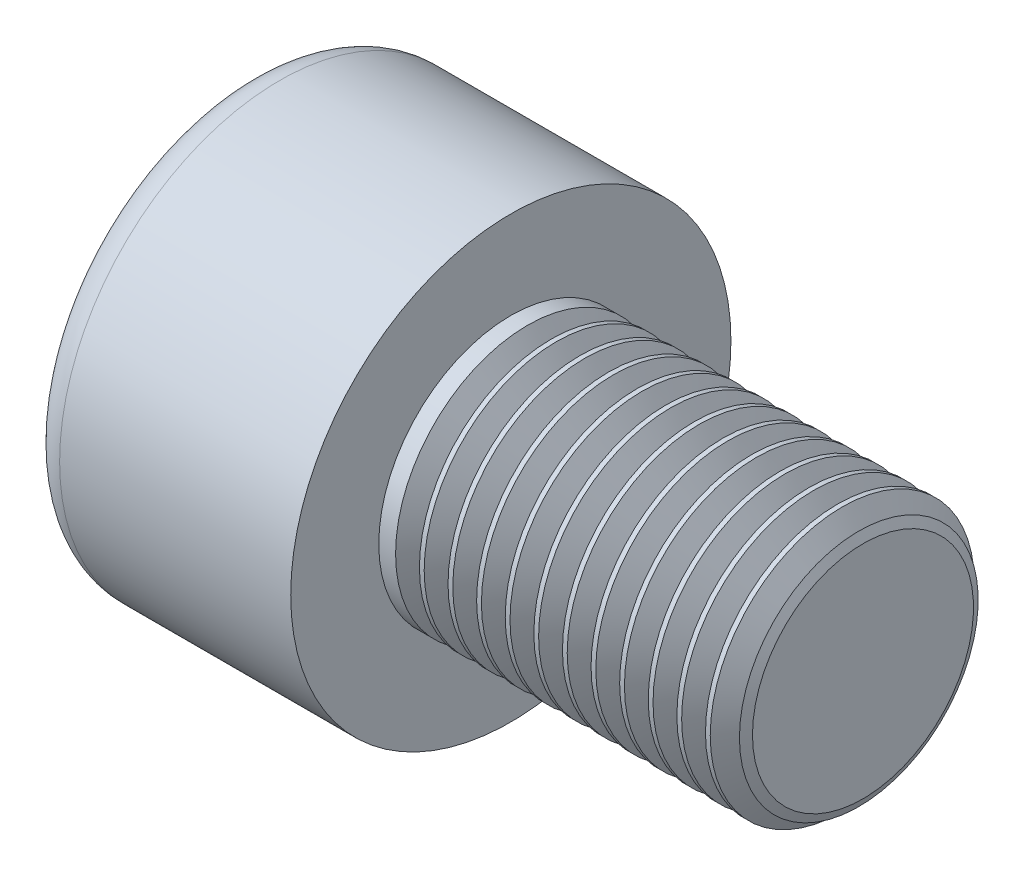
ISO-10303-21;
HEADER;
FILE_DESCRIPTION(('STEP AP214'),'2;1');
FILE_NAME('part.step','',(''),(''),'','','');
FILE_SCHEMA(('AUTOMOTIVE_DESIGN { 1 0 10303 214 1 1 1 1 }'));
ENDSEC;
DATA;
#1=APPLICATION_CONTEXT('core data for automotive mechanical design processes');
#2=APPLICATION_PROTOCOL_DEFINITION('international standard','automotive_design',2000,#1);
#3=PRODUCT_CONTEXT('',#1,'mechanical');
#4=PRODUCT('Part','Part','',(#3));
#5=PRODUCT_RELATED_PRODUCT_CATEGORY('part','',(#4));
#6=PRODUCT_DEFINITION_FORMATION('','',#4);
#7=PRODUCT_DEFINITION_CONTEXT('part definition',#1,'design');
#8=PRODUCT_DEFINITION('design','',#6,#7);
#9=PRODUCT_DEFINITION_SHAPE('','',#8);
#10=(LENGTH_UNIT() NAMED_UNIT(*) SI_UNIT(.MILLI.,.METRE.));
#11=(NAMED_UNIT(*) PLANE_ANGLE_UNIT() SI_UNIT($,.RADIAN.));
#12=(NAMED_UNIT(*) SI_UNIT($,.STERADIAN.) SOLID_ANGLE_UNIT());
#13=UNCERTAINTY_MEASURE_WITH_UNIT(LENGTH_MEASURE(1.E-05),#10,'distance_accuracy_value','');
#14=(GEOMETRIC_REPRESENTATION_CONTEXT(3) GLOBAL_UNCERTAINTY_ASSIGNED_CONTEXT((#13)) GLOBAL_UNIT_ASSIGNED_CONTEXT((#10,
#11,#12)) REPRESENTATION_CONTEXT('',''));
#15=CARTESIAN_POINT('',(0.,0.,0.));
#16=DIRECTION('',(0.,0.,1.));
#17=DIRECTION('',(1.,0.,0.));
#18=AXIS2_PLACEMENT_3D('',#15,#16,#17);
#19=CARTESIAN_POINT('',(13.8006,0.,0.));
#20=DIRECTION('',(1.,0.,0.));
#21=DIRECTION('',(0.,0.,-1.));
#22=AXIS2_PLACEMENT_3D('',#19,#20,#21);
#23=CONICAL_SURFACE('',#22,2.53104724385073,1.0471975511966);
#24=CARTESIAN_POINT('',(13.8006,0.,0.));
#25=DIRECTION('',(-1.,0.,0.));
#26=DIRECTION('',(0.,0.,1.));
#27=AXIS2_PLACEMENT_3D('',#24,#25,#26);
#28=CIRCLE('',#27,2.53104724385073);
#29=CARTESIAN_POINT('',(13.8006,0.,2.53104724385073));
#30=VERTEX_POINT('',#29);
#31=EDGE_CURVE('E121',#30,#30,#28,.T.);
#32=ORIENTED_EDGE('',*,*,#31,.F.);
#33=EDGE_LOOP('',(#32));
#34=FACE_BOUND('',#33,.T.);
#35=CARTESIAN_POINT('',(13.9049871614403,0.,0.));
#36=DIRECTION('',(-1.,0.,0.));
#37=DIRECTION('',(0.,0.,1.));
#38=AXIS2_PLACEMENT_3D('',#35,#36,#37);
#39=CIRCLE('',#38,2.71185111112316);
#40=CARTESIAN_POINT('',(13.9049871614403,0.,2.71185111112316));
#41=VERTEX_POINT('',#40);
#42=EDGE_CURVE('E642',#41,#41,#39,.T.);
#43=ORIENTED_EDGE('',*,*,#42,.T.);
#44=EDGE_LOOP('',(#43));
#45=FACE_BOUND('',#44,.T.);
#46=ADVANCED_FACE('F31',(#34,#45),#23,.T.);
#47=CARTESIAN_POINT('',(16.,0.,0.));
#48=DIRECTION('',(-1.,0.,0.));
#49=DIRECTION('',(0.,0.,1.));
#50=AXIS2_PLACEMENT_3D('',#47,#48,#49);
#51=CYLINDRICAL_SURFACE('',#50,3.);
#52=CARTESIAN_POINT('',(7.03185,0.,0.));
#53=DIRECTION('',(-1.,0.,0.));
#54=DIRECTION('',(0.,0.,1.));
#55=AXIS2_PLACEMENT_3D('',#52,#53,#54);
#56=CIRCLE('',#55,3.);
#57=CARTESIAN_POINT('',(7.03185,0.,3.));
#58=VERTEX_POINT('',#57);
#59=EDGE_CURVE('E654',#58,#58,#56,.T.);
#60=ORIENTED_EDGE('',*,*,#59,.T.);
#61=EDGE_LOOP('',(#60));
#62=FACE_BOUND('',#61,.T.);
#63=CARTESIAN_POINT('',(6.92355,0.,0.));
#64=DIRECTION('',(-1.,0.,0.));
#65=DIRECTION('',(0.,0.,1.));
#66=AXIS2_PLACEMENT_3D('',#63,#64,#65);
#67=CIRCLE('',#66,3.);
#68=CARTESIAN_POINT('',(6.92355,0.,3.));
#69=VERTEX_POINT('',#68);
#70=EDGE_CURVE('E641',#69,#69,#67,.T.);
#71=ORIENTED_EDGE('',*,*,#70,.F.);
#72=EDGE_LOOP('',(#71));
#73=FACE_BOUND('',#72,.T.);
#74=ADVANCED_FACE('F237',(#62,#73),#51,.T.);
#75=CARTESIAN_POINT('',(7.68165,0.,0.));
#76=DIRECTION('',(-1.,0.,0.));
#77=DIRECTION('',(0.,0.,1.));
#78=AXIS2_PLACEMENT_3D('',#75,#76,#77);
#79=CIRCLE('',#78,3.);
#80=CARTESIAN_POINT('',(7.68165,0.,3.));
#81=VERTEX_POINT('',#80);
#82=EDGE_CURVE('E663',#81,#81,#79,.T.);
#83=ORIENTED_EDGE('',*,*,#82,.T.);
#84=EDGE_LOOP('',(#83));
#85=FACE_BOUND('',#84,.T.);
#86=CARTESIAN_POINT('',(7.57335,0.,0.));
#87=DIRECTION('',(-1.,0.,0.));
#88=DIRECTION('',(0.,0.,1.));
#89=AXIS2_PLACEMENT_3D('',#86,#87,#88);
#90=CIRCLE('',#89,3.);
#91=CARTESIAN_POINT('',(7.57335,0.,3.));
#92=VERTEX_POINT('',#91);
#93=EDGE_CURVE('E657',#92,#92,#90,.T.);
#94=ORIENTED_EDGE('',*,*,#93,.F.);
#95=EDGE_LOOP('',(#94));
#96=FACE_BOUND('',#95,.T.);
#97=ADVANCED_FACE('F243',(#85,#96),#51,.T.);
#98=CARTESIAN_POINT('',(8.33145,0.,0.));
#99=DIRECTION('',(-1.,0.,0.));
#100=DIRECTION('',(0.,0.,1.));
#101=AXIS2_PLACEMENT_3D('',#98,#99,#100);
#102=CIRCLE('',#101,3.);
#103=CARTESIAN_POINT('',(8.33145,0.,3.));
#104=VERTEX_POINT('',#103);
#105=EDGE_CURVE('E672',#104,#104,#102,.T.);
#106=ORIENTED_EDGE('',*,*,#105,.T.);
#107=EDGE_LOOP('',(#106));
#108=FACE_BOUND('',#107,.T.);
#109=CARTESIAN_POINT('',(8.22315,0.,0.));
#110=DIRECTION('',(-1.,0.,0.));
#111=DIRECTION('',(0.,0.,1.));
#112=AXIS2_PLACEMENT_3D('',#109,#110,#111);
#113=CIRCLE('',#112,3.);
#114=CARTESIAN_POINT('',(8.22315,0.,3.));
#115=VERTEX_POINT('',#114);
#116=EDGE_CURVE('E666',#115,#115,#113,.T.);
#117=ORIENTED_EDGE('',*,*,#116,.F.);
#118=EDGE_LOOP('',(#117));
#119=FACE_BOUND('',#118,.T.);
#120=ADVANCED_FACE('F521',(#108,#119),#51,.T.);
#121=CARTESIAN_POINT('',(8.98125,0.,0.));
#122=DIRECTION('',(-1.,0.,0.));
#123=DIRECTION('',(0.,0.,1.));
#124=AXIS2_PLACEMENT_3D('',#121,#122,#123);
#125=CIRCLE('',#124,3.);
#126=CARTESIAN_POINT('',(8.98125,0.,3.));
#127=VERTEX_POINT('',#126);
#128=EDGE_CURVE('E681',#127,#127,#125,.T.);
#129=ORIENTED_EDGE('',*,*,#128,.T.);
#130=EDGE_LOOP('',(#129));
#131=FACE_BOUND('',#130,.T.);
#132=CARTESIAN_POINT('',(8.87295,0.,0.));
#133=DIRECTION('',(-1.,0.,0.));
#134=DIRECTION('',(0.,0.,1.));
#135=AXIS2_PLACEMENT_3D('',#132,#133,#134);
#136=CIRCLE('',#135,3.);
#137=CARTESIAN_POINT('',(8.87295,0.,3.));
#138=VERTEX_POINT('',#137);
#139=EDGE_CURVE('E675',#138,#138,#136,.T.);
#140=ORIENTED_EDGE('',*,*,#139,.F.);
#141=EDGE_LOOP('',(#140));
#142=FACE_BOUND('',#141,.T.);
#143=ADVANCED_FACE('F514',(#131,#142),#51,.T.);
#144=CARTESIAN_POINT('',(9.63105,0.,0.));
#145=DIRECTION('',(-1.,0.,0.));
#146=DIRECTION('',(0.,0.,1.));
#147=AXIS2_PLACEMENT_3D('',#144,#145,#146);
#148=CIRCLE('',#147,3.);
#149=CARTESIAN_POINT('',(9.63105,0.,3.));
#150=VERTEX_POINT('',#149);
#151=EDGE_CURVE('E690',#150,#150,#148,.T.);
#152=ORIENTED_EDGE('',*,*,#151,.T.);
#153=EDGE_LOOP('',(#152));
#154=FACE_BOUND('',#153,.T.);
#155=CARTESIAN_POINT('',(9.52275,0.,0.));
#156=DIRECTION('',(-1.,0.,0.));
#157=DIRECTION('',(0.,0.,1.));
#158=AXIS2_PLACEMENT_3D('',#155,#156,#157);
#159=CIRCLE('',#158,3.);
#160=CARTESIAN_POINT('',(9.52275,0.,3.));
#161=VERTEX_POINT('',#160);
#162=EDGE_CURVE('E684',#161,#161,#159,.T.);
#163=ORIENTED_EDGE('',*,*,#162,.F.);
#164=EDGE_LOOP('',(#163));
#165=FACE_BOUND('',#164,.T.);
#166=ADVANCED_FACE('F507',(#154,#165),#51,.T.);
#167=CARTESIAN_POINT('',(10.28085,0.,0.));
#168=DIRECTION('',(-1.,0.,0.));
#169=DIRECTION('',(0.,0.,1.));
#170=AXIS2_PLACEMENT_3D('',#167,#168,#169);
#171=CIRCLE('',#170,3.);
#172=CARTESIAN_POINT('',(10.28085,0.,3.));
#173=VERTEX_POINT('',#172);
#174=EDGE_CURVE('E699',#173,#173,#171,.T.);
#175=ORIENTED_EDGE('',*,*,#174,.T.);
#176=EDGE_LOOP('',(#175));
#177=FACE_BOUND('',#176,.T.);
#178=CARTESIAN_POINT('',(10.17255,0.,0.));
#179=DIRECTION('',(-1.,0.,0.));
#180=DIRECTION('',(0.,0.,1.));
#181=AXIS2_PLACEMENT_3D('',#178,#179,#180);
#182=CIRCLE('',#181,3.);
#183=CARTESIAN_POINT('',(10.17255,0.,3.));
#184=VERTEX_POINT('',#183);
#185=EDGE_CURVE('E693',#184,#184,#182,.T.);
#186=ORIENTED_EDGE('',*,*,#185,.F.);
#187=EDGE_LOOP('',(#186));
#188=FACE_BOUND('',#187,.T.);
#189=ADVANCED_FACE('F500',(#177,#188),#51,.T.);
#190=CARTESIAN_POINT('',(10.93065,0.,0.));
#191=DIRECTION('',(-1.,0.,0.));
#192=DIRECTION('',(0.,0.,1.));
#193=AXIS2_PLACEMENT_3D('',#190,#191,#192);
#194=CIRCLE('',#193,3.);
#195=CARTESIAN_POINT('',(10.93065,0.,3.));
#196=VERTEX_POINT('',#195);
#197=EDGE_CURVE('E708',#196,#196,#194,.T.);
#198=ORIENTED_EDGE('',*,*,#197,.T.);
#199=EDGE_LOOP('',(#198));
#200=FACE_BOUND('',#199,.T.);
#201=CARTESIAN_POINT('',(10.82235,0.,0.));
#202=DIRECTION('',(-1.,0.,0.));
#203=DIRECTION('',(0.,0.,1.));
#204=AXIS2_PLACEMENT_3D('',#201,#202,#203);
#205=CIRCLE('',#204,3.);
#206=CARTESIAN_POINT('',(10.82235,0.,3.));
#207=VERTEX_POINT('',#206);
#208=EDGE_CURVE('E702',#207,#207,#205,.T.);
#209=ORIENTED_EDGE('',*,*,#208,.F.);
#210=EDGE_LOOP('',(#209));
#211=FACE_BOUND('',#210,.T.);
#212=ADVANCED_FACE('F493',(#200,#211),#51,.T.);
#213=CARTESIAN_POINT('',(11.58045,0.,0.));
#214=DIRECTION('',(-1.,0.,0.));
#215=DIRECTION('',(0.,0.,1.));
#216=AXIS2_PLACEMENT_3D('',#213,#214,#215);
#217=CIRCLE('',#216,3.);
#218=CARTESIAN_POINT('',(11.58045,0.,3.));
#219=VERTEX_POINT('',#218);
#220=EDGE_CURVE('E717',#219,#219,#217,.T.);
#221=ORIENTED_EDGE('',*,*,#220,.T.);
#222=EDGE_LOOP('',(#221));
#223=FACE_BOUND('',#222,.T.);
#224=CARTESIAN_POINT('',(11.47215,0.,0.));
#225=DIRECTION('',(-1.,0.,0.));
#226=DIRECTION('',(0.,0.,1.));
#227=AXIS2_PLACEMENT_3D('',#224,#225,#226);
#228=CIRCLE('',#227,3.);
#229=CARTESIAN_POINT('',(11.47215,0.,3.));
#230=VERTEX_POINT('',#229);
#231=EDGE_CURVE('E711',#230,#230,#228,.T.);
#232=ORIENTED_EDGE('',*,*,#231,.F.);
#233=EDGE_LOOP('',(#232));
#234=FACE_BOUND('',#233,.T.);
#235=ADVANCED_FACE('F486',(#223,#234),#51,.T.);
#236=CARTESIAN_POINT('',(12.23025,0.,0.));
#237=DIRECTION('',(-1.,0.,0.));
#238=DIRECTION('',(0.,0.,1.));
#239=AXIS2_PLACEMENT_3D('',#236,#237,#238);
#240=CIRCLE('',#239,3.);
#241=CARTESIAN_POINT('',(12.23025,0.,3.));
#242=VERTEX_POINT('',#241);
#243=EDGE_CURVE('E726',#242,#242,#240,.T.);
#244=ORIENTED_EDGE('',*,*,#243,.T.);
#245=EDGE_LOOP('',(#244));
#246=FACE_BOUND('',#245,.T.);
#247=CARTESIAN_POINT('',(12.12195,0.,0.));
#248=DIRECTION('',(-1.,0.,0.));
#249=DIRECTION('',(0.,0.,1.));
#250=AXIS2_PLACEMENT_3D('',#247,#248,#249);
#251=CIRCLE('',#250,3.);
#252=CARTESIAN_POINT('',(12.12195,0.,3.));
#253=VERTEX_POINT('',#252);
#254=EDGE_CURVE('E720',#253,#253,#251,.T.);
#255=ORIENTED_EDGE('',*,*,#254,.F.);
#256=EDGE_LOOP('',(#255));
#257=FACE_BOUND('',#256,.T.);
#258=ADVANCED_FACE('F479',(#246,#257),#51,.T.);
#259=CARTESIAN_POINT('',(12.88005,0.,0.));
#260=DIRECTION('',(-1.,0.,0.));
#261=DIRECTION('',(0.,0.,1.));
#262=AXIS2_PLACEMENT_3D('',#259,#260,#261);
#263=CIRCLE('',#262,3.);
#264=CARTESIAN_POINT('',(12.88005,0.,3.));
#265=VERTEX_POINT('',#264);
#266=EDGE_CURVE('E735',#265,#265,#263,.T.);
#267=ORIENTED_EDGE('',*,*,#266,.T.);
#268=EDGE_LOOP('',(#267));
#269=FACE_BOUND('',#268,.T.);
#270=CARTESIAN_POINT('',(12.77175,0.,0.));
#271=DIRECTION('',(-1.,0.,0.));
#272=DIRECTION('',(0.,0.,1.));
#273=AXIS2_PLACEMENT_3D('',#270,#271,#272);
#274=CIRCLE('',#273,3.);
#275=CARTESIAN_POINT('',(12.77175,0.,3.));
#276=VERTEX_POINT('',#275);
#277=EDGE_CURVE('E729',#276,#276,#274,.T.);
#278=ORIENTED_EDGE('',*,*,#277,.F.);
#279=EDGE_LOOP('',(#278));
#280=FACE_BOUND('',#279,.T.);
#281=ADVANCED_FACE('F472',(#269,#280),#51,.T.);
#282=CARTESIAN_POINT('',(13.52985,0.,0.));
#283=DIRECTION('',(-1.,0.,0.));
#284=DIRECTION('',(0.,0.,1.));
#285=AXIS2_PLACEMENT_3D('',#282,#283,#284);
#286=CIRCLE('',#285,3.);
#287=CARTESIAN_POINT('',(13.52985,0.,3.));
#288=VERTEX_POINT('',#287);
#289=EDGE_CURVE('E744',#288,#288,#286,.T.);
#290=ORIENTED_EDGE('',*,*,#289,.T.);
#291=EDGE_LOOP('',(#290));
#292=FACE_BOUND('',#291,.T.);
#293=CARTESIAN_POINT('',(13.42155,0.,0.));
#294=DIRECTION('',(-1.,0.,0.));
#295=DIRECTION('',(0.,0.,1.));
#296=AXIS2_PLACEMENT_3D('',#293,#294,#295);
#297=CIRCLE('',#296,3.);
#298=CARTESIAN_POINT('',(13.42155,0.,3.));
#299=VERTEX_POINT('',#298);
#300=EDGE_CURVE('E738',#299,#299,#297,.T.);
#301=ORIENTED_EDGE('',*,*,#300,.F.);
#302=EDGE_LOOP('',(#301));
#303=FACE_BOUND('',#302,.T.);
#304=ADVANCED_FACE('F247',(#292,#303),#51,.T.);
#305=CARTESIAN_POINT('',(13.52985,0.,0.));
#306=DIRECTION('',(-1.,0.,0.));
#307=DIRECTION('',(0.,0.,1.));
#308=AXIS2_PLACEMENT_3D('',#305,#306,#307);
#309=CONICAL_SURFACE('',#308,3.,1.0471975511966);
#310=ORIENTED_EDGE('',*,*,#31,.T.);
#311=EDGE_LOOP('',(#310));
#312=FACE_BOUND('',#311,.T.);
#313=ORIENTED_EDGE('',*,*,#289,.F.);
#314=EDGE_LOOP('',(#313));
#315=FACE_BOUND('',#314,.T.);
#316=ADVANCED_FACE('F254',(#312,#315),#309,.T.);
#317=CARTESIAN_POINT('',(12.88005,0.,0.));
#318=DIRECTION('',(-1.,0.,0.));
#319=DIRECTION('',(0.,0.,1.));
#320=AXIS2_PLACEMENT_3D('',#317,#318,#319);
#321=CONICAL_SURFACE('',#320,3.,1.0471975511966);
#322=CARTESIAN_POINT('',(13.1508,0.,0.));
#323=DIRECTION('',(-1.,0.,0.));
#324=DIRECTION('',(0.,0.,1.));
#325=AXIS2_PLACEMENT_3D('',#322,#323,#324);
#326=CIRCLE('',#325,2.53104724385073);
#327=CARTESIAN_POINT('',(13.1508,0.,2.53104724385073));
#328=VERTEX_POINT('',#327);
#329=EDGE_CURVE('E741',#328,#328,#326,.T.);
#330=ORIENTED_EDGE('',*,*,#329,.T.);
#331=EDGE_LOOP('',(#330));
#332=FACE_BOUND('',#331,.T.);
#333=ORIENTED_EDGE('',*,*,#266,.F.);
#334=EDGE_LOOP('',(#333));
#335=FACE_BOUND('',#334,.T.);
#336=ADVANCED_FACE('F252',(#332,#335),#321,.T.);
#337=CARTESIAN_POINT('',(13.1508,0.,0.));
#338=DIRECTION('',(1.,0.,0.));
#339=DIRECTION('',(0.,0.,-1.));
#340=AXIS2_PLACEMENT_3D('',#337,#338,#339);
#341=CONICAL_SURFACE('',#340,2.53104724385073,1.0471975511966);
#342=ORIENTED_EDGE('',*,*,#300,.T.);
#343=EDGE_LOOP('',(#342));
#344=FACE_BOUND('',#343,.T.);
#345=ORIENTED_EDGE('',*,*,#329,.F.);
#346=EDGE_LOOP('',(#345));
#347=FACE_BOUND('',#346,.T.);
#348=ADVANCED_FACE('F448',(#344,#347),#341,.T.);
#349=CARTESIAN_POINT('',(12.23025,0.,0.));
#350=DIRECTION('',(-1.,0.,0.));
#351=DIRECTION('',(0.,0.,1.));
#352=AXIS2_PLACEMENT_3D('',#349,#350,#351);
#353=CONICAL_SURFACE('',#352,3.,1.0471975511966);
#354=CARTESIAN_POINT('',(12.501,0.,0.));
#355=DIRECTION('',(-1.,0.,0.));
#356=DIRECTION('',(0.,0.,1.));
#357=AXIS2_PLACEMENT_3D('',#354,#355,#356);
#358=CIRCLE('',#357,2.53104724385073);
#359=CARTESIAN_POINT('',(12.501,0.,2.53104724385073));
#360=VERTEX_POINT('',#359);
#361=EDGE_CURVE('E732',#360,#360,#358,.T.);
#362=ORIENTED_EDGE('',*,*,#361,.T.);
#363=EDGE_LOOP('',(#362));
#364=FACE_BOUND('',#363,.T.);
#365=ORIENTED_EDGE('',*,*,#243,.F.);
#366=EDGE_LOOP('',(#365));
#367=FACE_BOUND('',#366,.T.);
#368=ADVANCED_FACE('F440',(#364,#367),#353,.T.);
#369=CARTESIAN_POINT('',(12.501,0.,0.));
#370=DIRECTION('',(1.,0.,0.));
#371=DIRECTION('',(0.,0.,-1.));
#372=AXIS2_PLACEMENT_3D('',#369,#370,#371);
#373=CONICAL_SURFACE('',#372,2.53104724385073,1.0471975511966);
#374=ORIENTED_EDGE('',*,*,#277,.T.);
#375=EDGE_LOOP('',(#374));
#376=FACE_BOUND('',#375,.T.);
#377=ORIENTED_EDGE('',*,*,#361,.F.);
#378=EDGE_LOOP('',(#377));
#379=FACE_BOUND('',#378,.T.);
#380=ADVANCED_FACE('F432',(#376,#379),#373,.T.);
#381=CARTESIAN_POINT('',(11.58045,0.,0.));
#382=DIRECTION('',(-1.,0.,0.));
#383=DIRECTION('',(0.,0.,1.));
#384=AXIS2_PLACEMENT_3D('',#381,#382,#383);
#385=CONICAL_SURFACE('',#384,3.,1.0471975511966);
#386=CARTESIAN_POINT('',(11.8512,0.,0.));
#387=DIRECTION('',(-1.,0.,0.));
#388=DIRECTION('',(0.,0.,1.));
#389=AXIS2_PLACEMENT_3D('',#386,#387,#388);
#390=CIRCLE('',#389,2.53104724385073);
#391=CARTESIAN_POINT('',(11.8512,0.,2.53104724385073));
#392=VERTEX_POINT('',#391);
#393=EDGE_CURVE('E723',#392,#392,#390,.T.);
#394=ORIENTED_EDGE('',*,*,#393,.T.);
#395=EDGE_LOOP('',(#394));
#396=FACE_BOUND('',#395,.T.);
#397=ORIENTED_EDGE('',*,*,#220,.F.);
#398=EDGE_LOOP('',(#397));
#399=FACE_BOUND('',#398,.T.);
#400=ADVANCED_FACE('F424',(#396,#399),#385,.T.);
#401=CARTESIAN_POINT('',(11.8512,0.,0.));
#402=DIRECTION('',(1.,0.,0.));
#403=DIRECTION('',(0.,0.,-1.));
#404=AXIS2_PLACEMENT_3D('',#401,#402,#403);
#405=CONICAL_SURFACE('',#404,2.53104724385073,1.0471975511966);
#406=ORIENTED_EDGE('',*,*,#254,.T.);
#407=EDGE_LOOP('',(#406));
#408=FACE_BOUND('',#407,.T.);
#409=ORIENTED_EDGE('',*,*,#393,.F.);
#410=EDGE_LOOP('',(#409));
#411=FACE_BOUND('',#410,.T.);
#412=ADVANCED_FACE('F416',(#408,#411),#405,.T.);
#413=CARTESIAN_POINT('',(10.93065,0.,0.));
#414=DIRECTION('',(-1.,0.,0.));
#415=DIRECTION('',(0.,0.,1.));
#416=AXIS2_PLACEMENT_3D('',#413,#414,#415);
#417=CONICAL_SURFACE('',#416,3.,1.0471975511966);
#418=CARTESIAN_POINT('',(11.2014,0.,0.));
#419=DIRECTION('',(-1.,0.,0.));
#420=DIRECTION('',(0.,0.,1.));
#421=AXIS2_PLACEMENT_3D('',#418,#419,#420);
#422=CIRCLE('',#421,2.53104724385073);
#423=CARTESIAN_POINT('',(11.2014,0.,2.53104724385073));
#424=VERTEX_POINT('',#423);
#425=EDGE_CURVE('E714',#424,#424,#422,.T.);
#426=ORIENTED_EDGE('',*,*,#425,.T.);
#427=EDGE_LOOP('',(#426));
#428=FACE_BOUND('',#427,.T.);
#429=ORIENTED_EDGE('',*,*,#197,.F.);
#430=EDGE_LOOP('',(#429));
#431=FACE_BOUND('',#430,.T.);
#432=ADVANCED_FACE('F408',(#428,#431),#417,.T.);
#433=CARTESIAN_POINT('',(11.2014,0.,0.));
#434=DIRECTION('',(1.,0.,0.));
#435=DIRECTION('',(0.,0.,-1.));
#436=AXIS2_PLACEMENT_3D('',#433,#434,#435);
#437=CONICAL_SURFACE('',#436,2.53104724385073,1.0471975511966);
#438=ORIENTED_EDGE('',*,*,#231,.T.);
#439=EDGE_LOOP('',(#438));
#440=FACE_BOUND('',#439,.T.);
#441=ORIENTED_EDGE('',*,*,#425,.F.);
#442=EDGE_LOOP('',(#441));
#443=FACE_BOUND('',#442,.T.);
#444=ADVANCED_FACE('F400',(#440,#443),#437,.T.);
#445=CARTESIAN_POINT('',(10.28085,0.,0.));
#446=DIRECTION('',(-1.,0.,0.));
#447=DIRECTION('',(0.,0.,1.));
#448=AXIS2_PLACEMENT_3D('',#445,#446,#447);
#449=CONICAL_SURFACE('',#448,3.,1.0471975511966);
#450=CARTESIAN_POINT('',(10.5516,0.,0.));
#451=DIRECTION('',(-1.,0.,0.));
#452=DIRECTION('',(0.,0.,1.));
#453=AXIS2_PLACEMENT_3D('',#450,#451,#452);
#454=CIRCLE('',#453,2.53104724385073);
#455=CARTESIAN_POINT('',(10.5516,0.,2.53104724385073));
#456=VERTEX_POINT('',#455);
#457=EDGE_CURVE('E705',#456,#456,#454,.T.);
#458=ORIENTED_EDGE('',*,*,#457,.T.);
#459=EDGE_LOOP('',(#458));
#460=FACE_BOUND('',#459,.T.);
#461=ORIENTED_EDGE('',*,*,#174,.F.);
#462=EDGE_LOOP('',(#461));
#463=FACE_BOUND('',#462,.T.);
#464=ADVANCED_FACE('F392',(#460,#463),#449,.T.);
#465=CARTESIAN_POINT('',(10.5516,0.,0.));
#466=DIRECTION('',(1.,0.,0.));
#467=DIRECTION('',(0.,0.,-1.));
#468=AXIS2_PLACEMENT_3D('',#465,#466,#467);
#469=CONICAL_SURFACE('',#468,2.53104724385073,1.0471975511966);
#470=ORIENTED_EDGE('',*,*,#208,.T.);
#471=EDGE_LOOP('',(#470));
#472=FACE_BOUND('',#471,.T.);
#473=ORIENTED_EDGE('',*,*,#457,.F.);
#474=EDGE_LOOP('',(#473));
#475=FACE_BOUND('',#474,.T.);
#476=ADVANCED_FACE('F384',(#472,#475),#469,.T.);
#477=CARTESIAN_POINT('',(9.63105,0.,0.));
#478=DIRECTION('',(-1.,0.,0.));
#479=DIRECTION('',(0.,0.,1.));
#480=AXIS2_PLACEMENT_3D('',#477,#478,#479);
#481=CONICAL_SURFACE('',#480,3.,1.0471975511966);
#482=CARTESIAN_POINT('',(9.9018,0.,0.));
#483=DIRECTION('',(-1.,0.,0.));
#484=DIRECTION('',(0.,0.,1.));
#485=AXIS2_PLACEMENT_3D('',#482,#483,#484);
#486=CIRCLE('',#485,2.53104724385073);
#487=CARTESIAN_POINT('',(9.9018,0.,2.53104724385073));
#488=VERTEX_POINT('',#487);
#489=EDGE_CURVE('E696',#488,#488,#486,.T.);
#490=ORIENTED_EDGE('',*,*,#489,.T.);
#491=EDGE_LOOP('',(#490));
#492=FACE_BOUND('',#491,.T.);
#493=ORIENTED_EDGE('',*,*,#151,.F.);
#494=EDGE_LOOP('',(#493));
#495=FACE_BOUND('',#494,.T.);
#496=ADVANCED_FACE('F376',(#492,#495),#481,.T.);
#497=CARTESIAN_POINT('',(9.9018,0.,0.));
#498=DIRECTION('',(1.,0.,0.));
#499=DIRECTION('',(0.,0.,-1.));
#500=AXIS2_PLACEMENT_3D('',#497,#498,#499);
#501=CONICAL_SURFACE('',#500,2.53104724385073,1.0471975511966);
#502=ORIENTED_EDGE('',*,*,#185,.T.);
#503=EDGE_LOOP('',(#502));
#504=FACE_BOUND('',#503,.T.);
#505=ORIENTED_EDGE('',*,*,#489,.F.);
#506=EDGE_LOOP('',(#505));
#507=FACE_BOUND('',#506,.T.);
#508=ADVANCED_FACE('F368',(#504,#507),#501,.T.);
#509=CARTESIAN_POINT('',(8.98125,0.,0.));
#510=DIRECTION('',(-1.,0.,0.));
#511=DIRECTION('',(0.,0.,1.));
#512=AXIS2_PLACEMENT_3D('',#509,#510,#511);
#513=CONICAL_SURFACE('',#512,3.,1.0471975511966);
#514=CARTESIAN_POINT('',(9.252,0.,0.));
#515=DIRECTION('',(-1.,0.,0.));
#516=DIRECTION('',(0.,0.,1.));
#517=AXIS2_PLACEMENT_3D('',#514,#515,#516);
#518=CIRCLE('',#517,2.53104724385073);
#519=CARTESIAN_POINT('',(9.252,0.,2.53104724385073));
#520=VERTEX_POINT('',#519);
#521=EDGE_CURVE('E687',#520,#520,#518,.T.);
#522=ORIENTED_EDGE('',*,*,#521,.T.);
#523=EDGE_LOOP('',(#522));
#524=FACE_BOUND('',#523,.T.);
#525=ORIENTED_EDGE('',*,*,#128,.F.);
#526=EDGE_LOOP('',(#525));
#527=FACE_BOUND('',#526,.T.);
#528=ADVANCED_FACE('F360',(#524,#527),#513,.T.);
#529=CARTESIAN_POINT('',(9.252,0.,0.));
#530=DIRECTION('',(1.,0.,0.));
#531=DIRECTION('',(0.,0.,-1.));
#532=AXIS2_PLACEMENT_3D('',#529,#530,#531);
#533=CONICAL_SURFACE('',#532,2.53104724385073,1.0471975511966);
#534=ORIENTED_EDGE('',*,*,#162,.T.);
#535=EDGE_LOOP('',(#534));
#536=FACE_BOUND('',#535,.T.);
#537=ORIENTED_EDGE('',*,*,#521,.F.);
#538=EDGE_LOOP('',(#537));
#539=FACE_BOUND('',#538,.T.);
#540=ADVANCED_FACE('F352',(#536,#539),#533,.T.);
#541=CARTESIAN_POINT('',(8.33145,0.,0.));
#542=DIRECTION('',(-1.,0.,0.));
#543=DIRECTION('',(0.,0.,1.));
#544=AXIS2_PLACEMENT_3D('',#541,#542,#543);
#545=CONICAL_SURFACE('',#544,3.,1.0471975511966);
#546=CARTESIAN_POINT('',(8.6022,0.,0.));
#547=DIRECTION('',(-1.,0.,0.));
#548=DIRECTION('',(0.,0.,1.));
#549=AXIS2_PLACEMENT_3D('',#546,#547,#548);
#550=CIRCLE('',#549,2.53104724385073);
#551=CARTESIAN_POINT('',(8.6022,0.,2.53104724385073));
#552=VERTEX_POINT('',#551);
#553=EDGE_CURVE('E678',#552,#552,#550,.T.);
#554=ORIENTED_EDGE('',*,*,#553,.T.);
#555=EDGE_LOOP('',(#554));
#556=FACE_BOUND('',#555,.T.);
#557=ORIENTED_EDGE('',*,*,#105,.F.);
#558=EDGE_LOOP('',(#557));
#559=FACE_BOUND('',#558,.T.);
#560=ADVANCED_FACE('F344',(#556,#559),#545,.T.);
#561=CARTESIAN_POINT('',(8.6022,0.,0.));
#562=DIRECTION('',(1.,0.,0.));
#563=DIRECTION('',(0.,0.,-1.));
#564=AXIS2_PLACEMENT_3D('',#561,#562,#563);
#565=CONICAL_SURFACE('',#564,2.53104724385073,1.0471975511966);
#566=ORIENTED_EDGE('',*,*,#139,.T.);
#567=EDGE_LOOP('',(#566));
#568=FACE_BOUND('',#567,.T.);
#569=ORIENTED_EDGE('',*,*,#553,.F.);
#570=EDGE_LOOP('',(#569));
#571=FACE_BOUND('',#570,.T.);
#572=ADVANCED_FACE('F336',(#568,#571),#565,.T.);
#573=CARTESIAN_POINT('',(7.68165,0.,0.));
#574=DIRECTION('',(-1.,0.,0.));
#575=DIRECTION('',(0.,0.,1.));
#576=AXIS2_PLACEMENT_3D('',#573,#574,#575);
#577=CONICAL_SURFACE('',#576,3.,1.0471975511966);
#578=CARTESIAN_POINT('',(7.9524,0.,0.));
#579=DIRECTION('',(-1.,0.,0.));
#580=DIRECTION('',(0.,0.,1.));
#581=AXIS2_PLACEMENT_3D('',#578,#579,#580);
#582=CIRCLE('',#581,2.53104724385073);
#583=CARTESIAN_POINT('',(7.9524,0.,2.53104724385073));
#584=VERTEX_POINT('',#583);
#585=EDGE_CURVE('E669',#584,#584,#582,.T.);
#586=ORIENTED_EDGE('',*,*,#585,.T.);
#587=EDGE_LOOP('',(#586));
#588=FACE_BOUND('',#587,.T.);
#589=ORIENTED_EDGE('',*,*,#82,.F.);
#590=EDGE_LOOP('',(#589));
#591=FACE_BOUND('',#590,.T.);
#592=ADVANCED_FACE('F328',(#588,#591),#577,.T.);
#593=CARTESIAN_POINT('',(7.9524,0.,0.));
#594=DIRECTION('',(1.,0.,0.));
#595=DIRECTION('',(0.,0.,-1.));
#596=AXIS2_PLACEMENT_3D('',#593,#594,#595);
#597=CONICAL_SURFACE('',#596,2.53104724385073,1.0471975511966);
#598=ORIENTED_EDGE('',*,*,#116,.T.);
#599=EDGE_LOOP('',(#598));
#600=FACE_BOUND('',#599,.T.);
#601=ORIENTED_EDGE('',*,*,#585,.F.);
#602=EDGE_LOOP('',(#601));
#603=FACE_BOUND('',#602,.T.);
#604=ADVANCED_FACE('F320',(#600,#603),#597,.T.);
#605=CARTESIAN_POINT('',(7.03185,0.,0.));
#606=DIRECTION('',(-1.,0.,0.));
#607=DIRECTION('',(0.,0.,1.));
#608=AXIS2_PLACEMENT_3D('',#605,#606,#607);
#609=CONICAL_SURFACE('',#608,3.,1.0471975511966);
#610=CARTESIAN_POINT('',(7.3026,0.,0.));
#611=DIRECTION('',(-1.,0.,0.));
#612=DIRECTION('',(0.,0.,1.));
#613=AXIS2_PLACEMENT_3D('',#610,#611,#612);
#614=CIRCLE('',#613,2.53104724385073);
#615=CARTESIAN_POINT('',(7.3026,0.,2.53104724385073));
#616=VERTEX_POINT('',#615);
#617=EDGE_CURVE('E660',#616,#616,#614,.T.);
#618=ORIENTED_EDGE('',*,*,#617,.T.);
#619=EDGE_LOOP('',(#618));
#620=FACE_BOUND('',#619,.T.);
#621=ORIENTED_EDGE('',*,*,#59,.F.);
#622=EDGE_LOOP('',(#621));
#623=FACE_BOUND('',#622,.T.);
#624=ADVANCED_FACE('F312',(#620,#623),#609,.T.);
#625=CARTESIAN_POINT('',(7.3026,0.,0.));
#626=DIRECTION('',(1.,0.,0.));
#627=DIRECTION('',(0.,0.,-1.));
#628=AXIS2_PLACEMENT_3D('',#625,#626,#627);
#629=CONICAL_SURFACE('',#628,2.53104724385073,1.0471975511966);
#630=ORIENTED_EDGE('',*,*,#93,.T.);
#631=EDGE_LOOP('',(#630));
#632=FACE_BOUND('',#631,.T.);
#633=ORIENTED_EDGE('',*,*,#617,.F.);
#634=EDGE_LOOP('',(#633));
#635=FACE_BOUND('',#634,.T.);
#636=ADVANCED_FACE('F304',(#632,#635),#629,.T.);
#637=CARTESIAN_POINT('',(6.38205,0.,0.));
#638=DIRECTION('',(-1.,0.,0.));
#639=DIRECTION('',(0.,0.,1.));
#640=AXIS2_PLACEMENT_3D('',#637,#638,#639);
#641=CONICAL_SURFACE('',#640,3.,1.0471975511966);
#642=CARTESIAN_POINT('',(6.6528,0.,0.));
#643=DIRECTION('',(-1.,0.,0.));
#644=DIRECTION('',(0.,0.,1.));
#645=AXIS2_PLACEMENT_3D('',#642,#643,#644);
#646=CIRCLE('',#645,2.53104724385073);
#647=CARTESIAN_POINT('',(6.6528,0.,2.53104724385073));
#648=VERTEX_POINT('',#647);
#649=EDGE_CURVE('E645',#648,#648,#646,.T.);
#650=ORIENTED_EDGE('',*,*,#649,.T.);
#651=EDGE_LOOP('',(#650));
#652=FACE_BOUND('',#651,.T.);
#653=CARTESIAN_POINT('',(6.38205,0.,0.));
#654=DIRECTION('',(-1.,0.,0.));
#655=DIRECTION('',(0.,0.,1.));
#656=AXIS2_PLACEMENT_3D('',#653,#654,#655);
#657=CIRCLE('',#656,3.);
#658=CARTESIAN_POINT('',(6.38205,0.,3.));
#659=VERTEX_POINT('',#658);
#660=EDGE_CURVE('E639',#659,#659,#657,.T.);
#661=ORIENTED_EDGE('',*,*,#660,.F.);
#662=EDGE_LOOP('',(#661));
#663=FACE_BOUND('',#662,.T.);
#664=ADVANCED_FACE('F295',(#652,#663),#641,.T.);
#665=CARTESIAN_POINT('',(6.6528,0.,0.));
#666=DIRECTION('',(1.,0.,0.));
#667=DIRECTION('',(0.,0.,-1.));
#668=AXIS2_PLACEMENT_3D('',#665,#666,#667);
#669=CONICAL_SURFACE('',#668,2.53104724385073,1.0471975511966);
#670=ORIENTED_EDGE('',*,*,#70,.T.);
#671=EDGE_LOOP('',(#670));
#672=FACE_BOUND('',#671,.T.);
#673=ORIENTED_EDGE('',*,*,#649,.F.);
#674=EDGE_LOOP('',(#673));
#675=FACE_BOUND('',#674,.T.);
#676=ADVANCED_FACE('F108',(#672,#675),#669,.T.);
#677=CARTESIAN_POINT('',(3.,0.,0.));
#678=DIRECTION('',(-1.,0.,0.));
#679=DIRECTION('',(0.,0.,1.));
#680=AXIS2_PLACEMENT_3D('',#677,#678,#679);
#681=CONICAL_SURFACE('',#680,2.5,1.04719755119659);
#682=CARTESIAN_POINT('',(4.44337567297408,0.,0.));
#683=VERTEX_POINT('',#682);
#684=VERTEX_LOOP('',#683);
#685=FACE_BOUND('',#684,.T.);
#686=CARTESIAN_POINT('',(3.,0.,0.));
#687=DIRECTION('',(1.,0.,0.));
#688=DIRECTION('',(0.,0.,-1.));
#689=AXIS2_PLACEMENT_3D('',#686,#687,#688);
#690=CIRCLE('',#689,2.5);
#691=CARTESIAN_POINT('',(3.,1.25,-2.1650635094611));
#692=VERTEX_POINT('',#691);
#693=CARTESIAN_POINT('',(3.,2.5,0.));
#694=VERTEX_POINT('',#693);
#695=EDGE_CURVE('E111',#692,#694,#690,.T.);
#696=ORIENTED_EDGE('',*,*,#695,.F.);
#697=CARTESIAN_POINT('',(3.,0.,0.));
#698=DIRECTION('',(-1.,0.,0.));
#699=DIRECTION('',(0.,0.,1.));
#700=AXIS2_PLACEMENT_3D('',#697,#698,#699);
#701=CIRCLE('',#700,2.5);
#702=CARTESIAN_POINT('',(3.,-1.25,-2.1650635094611));
#703=VERTEX_POINT('',#702);
#704=EDGE_CURVE('E113',#703,#692,#701,.F.);
#705=ORIENTED_EDGE('',*,*,#704,.F.);
#706=CARTESIAN_POINT('',(3.,-2.5,0.));
#707=VERTEX_POINT('',#706);
#708=EDGE_CURVE('E132',#707,#703,#701,.F.);
#709=ORIENTED_EDGE('',*,*,#708,.F.);
#710=CARTESIAN_POINT('',(3.,-1.25,2.1650635094611));
#711=VERTEX_POINT('',#710);
#712=EDGE_CURVE('E46',#711,#707,#701,.F.);
#713=ORIENTED_EDGE('',*,*,#712,.F.);
#714=CARTESIAN_POINT('',(3.,1.25,2.1650635094611));
#715=VERTEX_POINT('',#714);
#716=EDGE_CURVE('E192',#715,#711,#701,.F.);
#717=ORIENTED_EDGE('',*,*,#716,.F.);
#718=EDGE_CURVE('E116',#694,#715,#701,.F.);
#719=ORIENTED_EDGE('',*,*,#718,.F.);
#720=EDGE_LOOP('',(#696,#705,#709,#713,#717,#719));
#721=FACE_BOUND('',#720,.T.);
#722=ADVANCED_FACE('F105',(#685,#721),#681,.F.);
#723=CARTESIAN_POINT('',(3.,-5.,0.));
#724=DIRECTION('',(-1.,0.,0.));
#725=DIRECTION('',(0.,0.,1.));
#726=AXIS2_PLACEMENT_3D('',#723,#724,#725);
#727=PLANE('',#726);
#728=DIRECTION('',(0.,-0.866025403784438,-0.5));
#729=VECTOR('',#728,1.);
#730=CARTESIAN_POINT('',(3.,0.,2.88675134594813));
#731=LINE('',#730,#729);
#732=CARTESIAN_POINT('',(3.,-2.5,1.44337567297407));
#733=VERTEX_POINT('',#732);
#734=EDGE_CURVE('E152',#711,#733,#731,.T.);
#735=ORIENTED_EDGE('',*,*,#734,.F.);
#736=ORIENTED_EDGE('',*,*,#712,.T.);
#737=DIRECTION('',(0.,0.,-1.));
#738=VECTOR('',#737,1.);
#739=CARTESIAN_POINT('',(3.,-2.5,1.44337567297407));
#740=LINE('',#739,#738);
#741=EDGE_CURVE('E157',#733,#707,#740,.T.);
#742=ORIENTED_EDGE('',*,*,#741,.F.);
#743=EDGE_LOOP('',(#735,#736,#742));
#744=FACE_BOUND('',#743,.T.);
#745=ADVANCED_FACE('F107',(#744),#727,.T.);
#746=DIRECTION('',(0.,-0.866025403784439,0.5));
#747=VECTOR('',#746,1.);
#748=CARTESIAN_POINT('',(3.,2.5,1.44337567297407));
#749=LINE('',#748,#747);
#750=CARTESIAN_POINT('',(3.,0.,2.88675134594813));
#751=VERTEX_POINT('',#750);
#752=EDGE_CURVE('E148',#715,#751,#749,.T.);
#753=ORIENTED_EDGE('',*,*,#752,.F.);
#754=ORIENTED_EDGE('',*,*,#716,.T.);
#755=EDGE_CURVE('E153',#751,#711,#731,.T.);
#756=ORIENTED_EDGE('',*,*,#755,.F.);
#757=EDGE_LOOP('',(#753,#754,#756));
#758=FACE_BOUND('',#757,.T.);
#759=ADVANCED_FACE('F214',(#758),#727,.T.);
#760=DIRECTION('',(0.,0.,1.));
#761=VECTOR('',#760,1.);
#762=CARTESIAN_POINT('',(3.,2.5,-1.44337567297406));
#763=LINE('',#762,#761);
#764=CARTESIAN_POINT('',(3.,2.5,1.44337567297407));
#765=VERTEX_POINT('',#764);
#766=EDGE_CURVE('E144',#694,#765,#763,.T.);
#767=ORIENTED_EDGE('',*,*,#766,.F.);
#768=ORIENTED_EDGE('',*,*,#718,.T.);
#769=EDGE_CURVE('E149',#765,#715,#749,.T.);
#770=ORIENTED_EDGE('',*,*,#769,.F.);
#771=EDGE_LOOP('',(#767,#768,#770));
#772=FACE_BOUND('',#771,.T.);
#773=ADVANCED_FACE('F217',(#772),#727,.T.);
#774=DIRECTION('',(0.,0.866025403784439,0.5));
#775=VECTOR('',#774,1.);
#776=CARTESIAN_POINT('',(3.,0.,-2.88675134594813));
#777=LINE('',#776,#775);
#778=CARTESIAN_POINT('',(3.,2.5,-1.44337567297406));
#779=VERTEX_POINT('',#778);
#780=EDGE_CURVE('E134',#692,#779,#777,.T.);
#781=ORIENTED_EDGE('',*,*,#780,.F.);
#782=ORIENTED_EDGE('',*,*,#695,.T.);
#783=EDGE_CURVE('E137',#779,#694,#763,.T.);
#784=ORIENTED_EDGE('',*,*,#783,.F.);
#785=EDGE_LOOP('',(#781,#782,#784));
#786=FACE_BOUND('',#785,.T.);
#787=ADVANCED_FACE('F135',(#786),#727,.T.);
#788=DIRECTION('',(0.,0.866025403784439,-0.5));
#789=VECTOR('',#788,1.);
#790=CARTESIAN_POINT('',(3.,-2.5,-1.44337567297406));
#791=LINE('',#790,#789);
#792=CARTESIAN_POINT('',(3.,0.,-2.88675134594813));
#793=VERTEX_POINT('',#792);
#794=EDGE_CURVE('E130',#703,#793,#791,.T.);
#795=ORIENTED_EDGE('',*,*,#794,.F.);
#796=ORIENTED_EDGE('',*,*,#704,.T.);
#797=EDGE_CURVE('E128',#793,#692,#777,.T.);
#798=ORIENTED_EDGE('',*,*,#797,.F.);
#799=EDGE_LOOP('',(#795,#796,#798));
#800=FACE_BOUND('',#799,.T.);
#801=ADVANCED_FACE('F126',(#800),#727,.T.);
#802=CARTESIAN_POINT('',(3.,-2.5,-1.44337567297406));
#803=VERTEX_POINT('',#802);
#804=EDGE_CURVE('E156',#707,#803,#740,.T.);
#805=ORIENTED_EDGE('',*,*,#804,.F.);
#806=ORIENTED_EDGE('',*,*,#708,.T.);
#807=EDGE_CURVE('E140',#803,#703,#791,.T.);
#808=ORIENTED_EDGE('',*,*,#807,.F.);
#809=EDGE_LOOP('',(#805,#806,#808));
#810=FACE_BOUND('',#809,.T.);
#811=ADVANCED_FACE('F202',(#810),#727,.T.);
#812=CARTESIAN_POINT('',(3.,-2.5,1.44337567297407));
#813=DIRECTION('',(0.,1.,0.));
#814=DIRECTION('',(0.,0.,1.));
#815=AXIS2_PLACEMENT_3D('',#812,#813,#814);
#816=PLANE('',#815);
#817=DIRECTION('',(0.,0.,-1.));
#818=VECTOR('',#817,1.);
#819=CARTESIAN_POINT('',(0.,-2.5,1.44337567297407));
#820=LINE('',#819,#818);
#821=CARTESIAN_POINT('',(0.,-2.5,1.44337567297407));
#822=VERTEX_POINT('',#821);
#823=CARTESIAN_POINT('',(0.,-2.5,-1.44337567297406));
#824=VERTEX_POINT('',#823);
#825=EDGE_CURVE('E174',#822,#824,#820,.T.);
#826=ORIENTED_EDGE('',*,*,#825,.F.);
#827=DIRECTION('',(-1.,0.,0.));
#828=VECTOR('',#827,1.);
#829=CARTESIAN_POINT('',(3.,-2.5,1.44337567297407));
#830=LINE('',#829,#828);
#831=EDGE_CURVE('E178',#733,#822,#830,.T.);
#832=ORIENTED_EDGE('',*,*,#831,.F.);
#833=ORIENTED_EDGE('',*,*,#741,.T.);
#834=ORIENTED_EDGE('',*,*,#804,.T.);
#835=DIRECTION('',(-1.,0.,0.));
#836=VECTOR('',#835,1.);
#837=CARTESIAN_POINT('',(3.,-2.5,-1.44337567297406));
#838=LINE('',#837,#836);
#839=EDGE_CURVE('E160',#803,#824,#838,.T.);
#840=ORIENTED_EDGE('',*,*,#839,.T.);
#841=EDGE_LOOP('',(#826,#832,#833,#834,#840));
#842=FACE_BOUND('',#841,.T.);
#843=ADVANCED_FACE('F206',(#842),#816,.T.);
#844=CARTESIAN_POINT('',(3.,0.,2.88675134594813));
#845=DIRECTION('',(0.,0.5,-0.866025403784438));
#846=DIRECTION('',(0.,0.866025403784439,0.5));
#847=AXIS2_PLACEMENT_3D('',#844,#845,#846);
#848=PLANE('',#847);
#849=DIRECTION('',(0.,-0.866025403784438,-0.5));
#850=VECTOR('',#849,1.);
#851=CARTESIAN_POINT('',(0.,0.,2.88675134594813));
#852=LINE('',#851,#850);
#853=CARTESIAN_POINT('',(0.,0.,2.88675134594813));
#854=VERTEX_POINT('',#853);
#855=EDGE_CURVE('E171',#854,#822,#852,.T.);
#856=ORIENTED_EDGE('',*,*,#855,.F.);
#857=DIRECTION('',(-1.,0.,0.));
#858=VECTOR('',#857,1.);
#859=CARTESIAN_POINT('',(3.,0.,2.88675134594813));
#860=LINE('',#859,#858);
#861=EDGE_CURVE('E180',#751,#854,#860,.T.);
#862=ORIENTED_EDGE('',*,*,#861,.F.);
#863=ORIENTED_EDGE('',*,*,#755,.T.);
#864=ORIENTED_EDGE('',*,*,#734,.T.);
#865=ORIENTED_EDGE('',*,*,#831,.T.);
#866=EDGE_LOOP('',(#856,#862,#863,#864,#865));
#867=FACE_BOUND('',#866,.T.);
#868=ADVANCED_FACE('F211',(#867),#848,.T.);
#869=CARTESIAN_POINT('',(3.,2.5,1.44337567297407));
#870=DIRECTION('',(0.,-0.5,-0.866025403784439));
#871=DIRECTION('',(0.,0.866025403784439,-0.5));
#872=AXIS2_PLACEMENT_3D('',#869,#870,#871);
#873=PLANE('',#872);
#874=DIRECTION('',(0.,-0.866025403784439,0.5));
#875=VECTOR('',#874,1.);
#876=CARTESIAN_POINT('',(0.,2.5,1.44337567297407));
#877=LINE('',#876,#875);
#878=CARTESIAN_POINT('',(0.,2.5,1.44337567297407));
#879=VERTEX_POINT('',#878);
#880=EDGE_CURVE('E168',#879,#854,#877,.T.);
#881=ORIENTED_EDGE('',*,*,#880,.F.);
#882=DIRECTION('',(-1.,0.,0.));
#883=VECTOR('',#882,1.);
#884=CARTESIAN_POINT('',(3.,2.5,1.44337567297407));
#885=LINE('',#884,#883);
#886=EDGE_CURVE('E182',#765,#879,#885,.T.);
#887=ORIENTED_EDGE('',*,*,#886,.F.);
#888=ORIENTED_EDGE('',*,*,#769,.T.);
#889=ORIENTED_EDGE('',*,*,#752,.T.);
#890=ORIENTED_EDGE('',*,*,#861,.T.);
#891=EDGE_LOOP('',(#881,#887,#888,#889,#890));
#892=FACE_BOUND('',#891,.T.);
#893=ADVANCED_FACE('F227',(#892),#873,.T.);
#894=CARTESIAN_POINT('',(3.,2.5,-1.44337567297406));
#895=DIRECTION('',(0.,-1.,0.));
#896=DIRECTION('',(0.,0.,-1.));
#897=AXIS2_PLACEMENT_3D('',#894,#895,#896);
#898=PLANE('',#897);
#899=DIRECTION('',(0.,0.,1.));
#900=VECTOR('',#899,1.);
#901=CARTESIAN_POINT('',(0.,2.5,-1.44337567297406));
#902=LINE('',#901,#900);
#903=CARTESIAN_POINT('',(0.,2.5,-1.44337567297406));
#904=VERTEX_POINT('',#903);
#905=EDGE_CURVE('E165',#904,#879,#902,.T.);
#906=ORIENTED_EDGE('',*,*,#905,.F.);
#907=DIRECTION('',(-1.,0.,0.));
#908=VECTOR('',#907,1.);
#909=CARTESIAN_POINT('',(3.,2.5,-1.44337567297406));
#910=LINE('',#909,#908);
#911=EDGE_CURVE('E184',#779,#904,#910,.T.);
#912=ORIENTED_EDGE('',*,*,#911,.F.);
#913=ORIENTED_EDGE('',*,*,#783,.T.);
#914=ORIENTED_EDGE('',*,*,#766,.T.);
#915=ORIENTED_EDGE('',*,*,#886,.T.);
#916=EDGE_LOOP('',(#906,#912,#913,#914,#915));
#917=FACE_BOUND('',#916,.T.);
#918=ADVANCED_FACE('F221',(#917),#898,.T.);
#919=CARTESIAN_POINT('',(3.,0.,-2.88675134594813));
#920=DIRECTION('',(0.,-0.5,0.866025403784438));
#921=DIRECTION('',(0.,-0.866025403784439,-0.5));
#922=AXIS2_PLACEMENT_3D('',#919,#920,#921);
#923=PLANE('',#922);
#924=DIRECTION('',(0.,0.866025403784439,0.5));
#925=VECTOR('',#924,1.);
#926=CARTESIAN_POINT('',(0.,0.,-2.88675134594813));
#927=LINE('',#926,#925);
#928=CARTESIAN_POINT('',(0.,0.,-2.88675134594813));
#929=VERTEX_POINT('',#928);
#930=EDGE_CURVE('E162',#929,#904,#927,.T.);
#931=ORIENTED_EDGE('',*,*,#930,.F.);
#932=DIRECTION('',(-1.,0.,0.));
#933=VECTOR('',#932,1.);
#934=CARTESIAN_POINT('',(3.,0.,-2.88675134594813));
#935=LINE('',#934,#933);
#936=EDGE_CURVE('E143',#793,#929,#935,.T.);
#937=ORIENTED_EDGE('',*,*,#936,.F.);
#938=ORIENTED_EDGE('',*,*,#797,.T.);
#939=ORIENTED_EDGE('',*,*,#780,.T.);
#940=ORIENTED_EDGE('',*,*,#911,.T.);
#941=EDGE_LOOP('',(#931,#937,#938,#939,#940));
#942=FACE_BOUND('',#941,.T.);
#943=ADVANCED_FACE('F142',(#942),#923,.T.);
#944=CARTESIAN_POINT('',(3.,-2.5,-1.44337567297406));
#945=DIRECTION('',(0.,0.5,0.866025403784439));
#946=DIRECTION('',(0.,-0.866025403784439,0.5));
#947=AXIS2_PLACEMENT_3D('',#944,#945,#946);
#948=PLANE('',#947);
#949=DIRECTION('',(0.,0.866025403784439,-0.5));
#950=VECTOR('',#949,1.);
#951=CARTESIAN_POINT('',(0.,-2.5,-1.44337567297406));
#952=LINE('',#951,#950);
#953=EDGE_CURVE('E54',#824,#929,#952,.T.);
#954=ORIENTED_EDGE('',*,*,#953,.F.);
#955=ORIENTED_EDGE('',*,*,#839,.F.);
#956=ORIENTED_EDGE('',*,*,#807,.T.);
#957=ORIENTED_EDGE('',*,*,#794,.T.);
#958=ORIENTED_EDGE('',*,*,#936,.T.);
#959=EDGE_LOOP('',(#954,#955,#956,#957,#958));
#960=FACE_BOUND('',#959,.T.);
#961=ADVANCED_FACE('F223',(#960),#948,.T.);
#962=CARTESIAN_POINT('',(0.,0.,0.));
#963=DIRECTION('',(1.,0.,0.));
#964=DIRECTION('',(0.,0.,-1.));
#965=AXIS2_PLACEMENT_3D('',#962,#963,#964);
#966=PLANE('',#965);
#967=CARTESIAN_POINT('',(0.,0.,0.));
#968=DIRECTION('',(1.,0.,0.));
#969=DIRECTION('',(0.,0.,-1.));
#970=AXIS2_PLACEMENT_3D('',#967,#968,#969);
#971=CIRCLE('',#970,4.25);
#972=CARTESIAN_POINT('',(0.,0.,-4.25));
#973=VERTEX_POINT('',#972);
#974=EDGE_CURVE('E11',#973,#973,#971,.F.);
#975=ORIENTED_EDGE('',*,*,#974,.T.);
#976=EDGE_LOOP('',(#975));
#977=FACE_BOUND('',#976,.T.);
#978=ORIENTED_EDGE('',*,*,#953,.T.);
#979=ORIENTED_EDGE('',*,*,#930,.T.);
#980=ORIENTED_EDGE('',*,*,#905,.T.);
#981=ORIENTED_EDGE('',*,*,#880,.T.);
#982=ORIENTED_EDGE('',*,*,#855,.T.);
#983=ORIENTED_EDGE('',*,*,#825,.T.);
#984=EDGE_LOOP('',(#978,#979,#980,#981,#982,#983));
#985=FACE_BOUND('',#984,.T.);
#986=ADVANCED_FACE('F224',(#977,#985),#966,.F.);
#987=CARTESIAN_POINT('',(0.75,0.,0.));
#988=DIRECTION('',(1.,0.,0.));
#989=DIRECTION('',(0.,0.,-1.));
#990=AXIS2_PLACEMENT_3D('',#987,#988,#989);
#991=TOROIDAL_SURFACE('',#990,4.25,0.75);
#992=ORIENTED_EDGE('',*,*,#974,.F.);
#993=EDGE_LOOP('',(#992));
#994=FACE_BOUND('',#993,.T.);
#995=CARTESIAN_POINT('',(0.75,0.,0.));
#996=DIRECTION('',(1.,0.,0.));
#997=DIRECTION('',(0.,0.,-1.));
#998=AXIS2_PLACEMENT_3D('',#995,#996,#997);
#999=CIRCLE('',#998,5.);
#1000=CARTESIAN_POINT('',(0.75,0.,-5.));
#1001=VERTEX_POINT('',#1000);
#1002=EDGE_CURVE('E39',#1001,#1001,#999,.T.);
#1003=ORIENTED_EDGE('',*,*,#1002,.F.);
#1004=EDGE_LOOP('',(#1003));
#1005=FACE_BOUND('',#1004,.T.);
#1006=ADVANCED_FACE('F33',(#994,#1005),#991,.T.);
#1007=CARTESIAN_POINT('',(6.,0.,0.));
#1008=DIRECTION('',(-1.,0.,0.));
#1009=DIRECTION('',(0.,0.,1.));
#1010=AXIS2_PLACEMENT_3D('',#1007,#1008,#1009);
#1011=CYLINDRICAL_SURFACE('',#1010,5.);
#1012=ORIENTED_EDGE('',*,*,#1002,.T.);
#1013=EDGE_LOOP('',(#1012));
#1014=FACE_BOUND('',#1013,.T.);
#1015=CARTESIAN_POINT('',(6.,0.,0.));
#1016=DIRECTION('',(1.,0.,0.));
#1017=DIRECTION('',(0.,0.,-1.));
#1018=AXIS2_PLACEMENT_3D('',#1015,#1016,#1017);
#1019=CIRCLE('',#1018,5.);
#1020=CARTESIAN_POINT('',(6.,0.,-5.));
#1021=VERTEX_POINT('',#1020);
#1022=EDGE_CURVE('E190',#1021,#1021,#1019,.T.);
#1023=ORIENTED_EDGE('',*,*,#1022,.F.);
#1024=EDGE_LOOP('',(#1023));
#1025=FACE_BOUND('',#1024,.T.);
#1026=ADVANCED_FACE('F548',(#1014,#1025),#1011,.T.);
#1027=CARTESIAN_POINT('',(6.,0.,0.));
#1028=DIRECTION('',(1.,0.,0.));
#1029=DIRECTION('',(0.,0.,-1.));
#1030=AXIS2_PLACEMENT_3D('',#1027,#1028,#1029);
#1031=PLANE('',#1030);
#1032=ORIENTED_EDGE('',*,*,#1022,.T.);
#1033=EDGE_LOOP('',(#1032));
#1034=FACE_BOUND('',#1033,.T.);
#1035=CARTESIAN_POINT('',(6.,0.,0.));
#1036=DIRECTION('',(1.,0.,0.));
#1037=DIRECTION('',(0.,0.,-1.));
#1038=AXIS2_PLACEMENT_3D('',#1035,#1036,#1037);
#1039=CIRCLE('',#1038,3.);
#1040=CARTESIAN_POINT('',(6.,0.,-3.));
#1041=VERTEX_POINT('',#1040);
#1042=EDGE_CURVE('E187',#1041,#1041,#1039,.T.);
#1043=ORIENTED_EDGE('',*,*,#1042,.F.);
#1044=EDGE_LOOP('',(#1043));
#1045=FACE_BOUND('',#1044,.T.);
#1046=ADVANCED_FACE('F557',(#1034,#1045),#1031,.T.);
#1047=ORIENTED_EDGE('',*,*,#1042,.T.);
#1048=EDGE_LOOP('',(#1047));
#1049=FACE_BOUND('',#1048,.T.);
#1050=ORIENTED_EDGE('',*,*,#660,.T.);
#1051=EDGE_LOOP('',(#1050));
#1052=FACE_BOUND('',#1051,.T.);
#1053=ADVANCED_FACE('F246',(#1049,#1052),#51,.T.);
#1054=CARTESIAN_POINT('',(13.7099855409239,0.,0.));
#1055=DIRECTION('',(-1.,0.,0.));
#1056=DIRECTION('',(0.,0.,1.));
#1057=AXIS2_PLACEMENT_3D('',#1054,#1055,#1056);
#1058=CONICAL_SURFACE('',#1057,3.12460014591896,1.12943390655716);
#1059=ORIENTED_EDGE('',*,*,#42,.F.);
#1060=EDGE_LOOP('',(#1059));
#1061=FACE_BOUND('',#1060,.T.);
#1062=CARTESIAN_POINT('',(14.,0.,0.));
#1063=DIRECTION('',(-1.,0.,0.));
#1064=DIRECTION('',(0.,0.,1.));
#1065=AXIS2_PLACEMENT_3D('',#1062,#1063,#1064);
#1066=CIRCLE('',#1065,2.51074274440854);
#1067=CARTESIAN_POINT('',(14.,0.,2.51074274440854));
#1068=VERTEX_POINT('',#1067);
#1069=EDGE_CURVE('E648',#1068,#1068,#1066,.T.);
#1070=ORIENTED_EDGE('',*,*,#1069,.T.);
#1071=EDGE_LOOP('',(#1070));
#1072=FACE_BOUND('',#1071,.T.);
#1073=ADVANCED_FACE('F631',(#1061,#1072),#1058,.T.);
#1074=CARTESIAN_POINT('',(14.,-3.4615756871854,6.94465184447763));
#1075=DIRECTION('',(1.,0.,0.));
#1076=DIRECTION('',(0.,0.,-1.));
#1077=AXIS2_PLACEMENT_3D('',#1074,#1075,#1076);
#1078=PLANE('',#1077);
#1079=ORIENTED_EDGE('',*,*,#1069,.F.);
#1080=EDGE_LOOP('',(#1079));
#1081=FACE_BOUND('',#1080,.T.);
#1082=ADVANCED_FACE('F818',(#1081),#1078,.T.);
#1083=CLOSED_SHELL('',(#46,#74,#97,#120,#143,#166,#189,#212,#235,#258,#281,#304,#316,#336,#348,
#368,#380,#400,#412,#432,#444,#464,#476,#496,#508,#528,#540,#560,#572,#592,#604,#624,#636,#664,
#676,#722,#745,#759,#773,#787,#801,#811,#843,#868,#893,#918,#943,#961,#986,#1006,#1026,#1046,
#1053,#1073,#1082));
#1084=MANIFOLD_SOLID_BREP('B2',#1083);
#1085=ADVANCED_BREP_SHAPE_REPRESENTATION('',(#18,#1084),#14);
#1086=SHAPE_DEFINITION_REPRESENTATION(#9,#1085);
ENDSEC;
END-ISO-10303-21;
